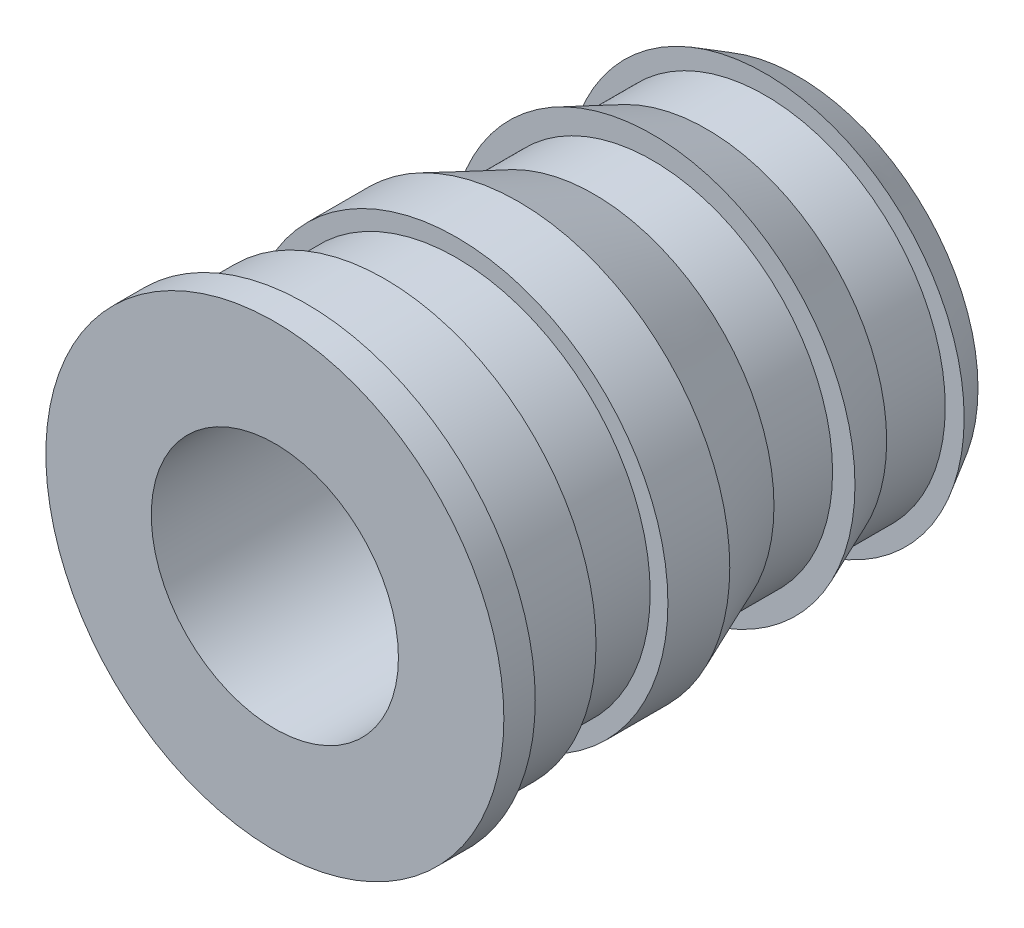
ISO-10303-21;
HEADER;
FILE_DESCRIPTION(('STEP AP214'),'2;1');
FILE_NAME('part.step','',(''),(''),'','','');
FILE_SCHEMA(('AUTOMOTIVE_DESIGN { 1 0 10303 214 1 1 1 1 }'));
ENDSEC;
DATA;
#1=APPLICATION_CONTEXT('core data for automotive mechanical design processes');
#2=APPLICATION_PROTOCOL_DEFINITION('international standard','automotive_design',2000,#1);
#3=PRODUCT_CONTEXT('',#1,'mechanical');
#4=PRODUCT('Part','Part','',(#3));
#5=PRODUCT_RELATED_PRODUCT_CATEGORY('part','',(#4));
#6=PRODUCT_DEFINITION_FORMATION('','',#4);
#7=PRODUCT_DEFINITION_CONTEXT('part definition',#1,'design');
#8=PRODUCT_DEFINITION('design','',#6,#7);
#9=PRODUCT_DEFINITION_SHAPE('','',#8);
#10=(LENGTH_UNIT() NAMED_UNIT(*) SI_UNIT(.MILLI.,.METRE.));
#11=(NAMED_UNIT(*) PLANE_ANGLE_UNIT() SI_UNIT($,.RADIAN.));
#12=(NAMED_UNIT(*) SI_UNIT($,.STERADIAN.) SOLID_ANGLE_UNIT());
#13=UNCERTAINTY_MEASURE_WITH_UNIT(LENGTH_MEASURE(1.E-05),#10,'distance_accuracy_value','');
#14=(GEOMETRIC_REPRESENTATION_CONTEXT(3) GLOBAL_UNCERTAINTY_ASSIGNED_CONTEXT((#13)) GLOBAL_UNIT_ASSIGNED_CONTEXT((#10,
#11,#12)) REPRESENTATION_CONTEXT('',''));
#15=CARTESIAN_POINT('',(0.,0.,0.));
#16=DIRECTION('',(0.,0.,1.));
#17=DIRECTION('',(1.,0.,0.));
#18=AXIS2_PLACEMENT_3D('',#15,#16,#17);
#19=CARTESIAN_POINT('',(0.,0.,3.175));
#20=DIRECTION('',(0.,0.,1.));
#21=DIRECTION('',(1.,0.,0.));
#22=AXIS2_PLACEMENT_3D('',#19,#20,#21);
#23=CYLINDRICAL_SURFACE('',#22,1.5);
#24=CARTESIAN_POINT('',(0.,0.,-3.175));
#25=DIRECTION('',(0.,0.,1.));
#26=DIRECTION('',(1.,0.,0.));
#27=AXIS2_PLACEMENT_3D('',#24,#25,#26);
#28=CIRCLE('',#27,1.5);
#29=CARTESIAN_POINT('',(1.5,0.,-3.175));
#30=VERTEX_POINT('',#29);
#31=EDGE_CURVE('E110',#30,#30,#28,.T.);
#32=ORIENTED_EDGE('',*,*,#31,.F.);
#33=EDGE_LOOP('',(#32));
#34=FACE_BOUND('',#33,.T.);
#35=CARTESIAN_POINT('',(0.,0.,3.175));
#36=DIRECTION('',(0.,0.,1.));
#37=DIRECTION('',(1.,0.,0.));
#38=AXIS2_PLACEMENT_3D('',#35,#36,#37);
#39=CIRCLE('',#38,1.5);
#40=CARTESIAN_POINT('',(1.5,0.,3.175));
#41=VERTEX_POINT('',#40);
#42=EDGE_CURVE('E10',#41,#41,#39,.T.);
#43=ORIENTED_EDGE('',*,*,#42,.T.);
#44=EDGE_LOOP('',(#43));
#45=FACE_BOUND('',#44,.T.);
#46=ADVANCED_FACE('F39',(#34,#45),#23,.F.);
#47=CARTESIAN_POINT('',(0.,1.5,3.175));
#48=DIRECTION('',(0.,0.,-1.));
#49=DIRECTION('',(-1.,0.,0.));
#50=AXIS2_PLACEMENT_3D('',#47,#48,#49);
#51=PLANE('',#50);
#52=ORIENTED_EDGE('',*,*,#42,.F.);
#53=EDGE_LOOP('',(#52));
#54=FACE_BOUND('',#53,.T.);
#55=CARTESIAN_POINT('',(0.,0.,3.175));
#56=DIRECTION('',(0.,0.,1.));
#57=DIRECTION('',(1.,0.,0.));
#58=AXIS2_PLACEMENT_3D('',#55,#56,#57);
#59=CIRCLE('',#58,2.78);
#60=CARTESIAN_POINT('',(2.78,0.,3.175));
#61=VERTEX_POINT('',#60);
#62=EDGE_CURVE('E46',#61,#61,#59,.T.);
#63=ORIENTED_EDGE('',*,*,#62,.T.);
#64=EDGE_LOOP('',(#63));
#65=FACE_BOUND('',#64,.T.);
#66=ADVANCED_FACE('F118',(#54,#65),#51,.F.);
#67=CARTESIAN_POINT('',(0.,0.,3.175));
#68=DIRECTION('',(0.,0.,1.));
#69=DIRECTION('',(1.,0.,0.));
#70=AXIS2_PLACEMENT_3D('',#67,#68,#69);
#71=CYLINDRICAL_SURFACE('',#70,2.78);
#72=ORIENTED_EDGE('',*,*,#62,.F.);
#73=EDGE_LOOP('',(#72));
#74=FACE_BOUND('',#73,.T.);
#75=CARTESIAN_POINT('',(0.,0.,2.794));
#76=DIRECTION('',(0.,0.,1.));
#77=DIRECTION('',(1.,0.,0.));
#78=AXIS2_PLACEMENT_3D('',#75,#76,#77);
#79=CIRCLE('',#78,2.78);
#80=CARTESIAN_POINT('',(2.78,0.,2.794));
#81=VERTEX_POINT('',#80);
#82=EDGE_CURVE('E51',#81,#81,#79,.T.);
#83=ORIENTED_EDGE('',*,*,#82,.T.);
#84=EDGE_LOOP('',(#83));
#85=FACE_BOUND('',#84,.T.);
#86=ADVANCED_FACE('F122',(#74,#85),#71,.T.);
#87=CARTESIAN_POINT('',(0.,2.78,2.794));
#88=DIRECTION('',(0.,0.,1.));
#89=DIRECTION('',(1.,0.,0.));
#90=AXIS2_PLACEMENT_3D('',#87,#88,#89);
#91=PLANE('',#90);
#92=ORIENTED_EDGE('',*,*,#82,.F.);
#93=EDGE_LOOP('',(#92));
#94=FACE_BOUND('',#93,.T.);
#95=CARTESIAN_POINT('',(0.,0.,2.794));
#96=DIRECTION('',(0.,0.,1.));
#97=DIRECTION('',(1.,0.,0.));
#98=AXIS2_PLACEMENT_3D('',#95,#96,#97);
#99=CIRCLE('',#98,2.565);
#100=CARTESIAN_POINT('',(2.565,0.,2.794));
#101=VERTEX_POINT('',#100);
#102=EDGE_CURVE('E56',#101,#101,#99,.T.);
#103=ORIENTED_EDGE('',*,*,#102,.T.);
#104=EDGE_LOOP('',(#103));
#105=FACE_BOUND('',#104,.T.);
#106=ADVANCED_FACE('F127',(#94,#105),#91,.F.);
#107=CARTESIAN_POINT('',(0.,0.,3.175));
#108=DIRECTION('',(0.,0.,1.));
#109=DIRECTION('',(1.,0.,0.));
#110=AXIS2_PLACEMENT_3D('',#107,#108,#109);
#111=CYLINDRICAL_SURFACE('',#110,2.565);
#112=ORIENTED_EDGE('',*,*,#102,.F.);
#113=EDGE_LOOP('',(#112));
#114=FACE_BOUND('',#113,.T.);
#115=CARTESIAN_POINT('',(0.,0.,1.8415));
#116=DIRECTION('',(0.,0.,1.));
#117=DIRECTION('',(1.,0.,0.));
#118=AXIS2_PLACEMENT_3D('',#115,#116,#117);
#119=CIRCLE('',#118,2.565);
#120=CARTESIAN_POINT('',(2.565,0.,1.8415));
#121=VERTEX_POINT('',#120);
#122=EDGE_CURVE('E62',#121,#121,#119,.T.);
#123=ORIENTED_EDGE('',*,*,#122,.T.);
#124=EDGE_LOOP('',(#123));
#125=FACE_BOUND('',#124,.T.);
#126=ADVANCED_FACE('F133',(#114,#125),#111,.T.);
#127=CARTESIAN_POINT('',(0.,2.565,1.8415));
#128=DIRECTION('',(0.,0.,1.));
#129=DIRECTION('',(1.,0.,0.));
#130=AXIS2_PLACEMENT_3D('',#127,#128,#129);
#131=PLANE('',#130);
#132=ORIENTED_EDGE('',*,*,#122,.F.);
#133=EDGE_LOOP('',(#132));
#134=FACE_BOUND('',#133,.T.);
#135=CARTESIAN_POINT('',(0.,0.,1.8415));
#136=DIRECTION('',(0.,0.,1.));
#137=DIRECTION('',(1.,0.,0.));
#138=AXIS2_PLACEMENT_3D('',#135,#136,#137);
#139=CIRCLE('',#138,2.35);
#140=CARTESIAN_POINT('',(2.35,0.,1.8415));
#141=VERTEX_POINT('',#140);
#142=EDGE_CURVE('E66',#141,#141,#139,.T.);
#143=ORIENTED_EDGE('',*,*,#142,.T.);
#144=EDGE_LOOP('',(#143));
#145=FACE_BOUND('',#144,.T.);
#146=ADVANCED_FACE('F137',(#134,#145),#131,.F.);
#147=CARTESIAN_POINT('',(0.,0.,3.175));
#148=DIRECTION('',(0.,0.,1.));
#149=DIRECTION('',(1.,0.,0.));
#150=AXIS2_PLACEMENT_3D('',#147,#148,#149);
#151=CYLINDRICAL_SURFACE('',#150,2.35);
#152=ORIENTED_EDGE('',*,*,#142,.F.);
#153=EDGE_LOOP('',(#152));
#154=FACE_BOUND('',#153,.T.);
#155=CARTESIAN_POINT('',(0.,0.,0.968638131010374));
#156=DIRECTION('',(0.,0.,1.));
#157=DIRECTION('',(1.,0.,0.));
#158=AXIS2_PLACEMENT_3D('',#155,#156,#157);
#159=CIRCLE('',#158,2.35);
#160=CARTESIAN_POINT('',(2.35,0.,0.968638131010374));
#161=VERTEX_POINT('',#160);
#162=EDGE_CURVE('E70',#161,#161,#159,.T.);
#163=ORIENTED_EDGE('',*,*,#162,.T.);
#164=EDGE_LOOP('',(#163));
#165=FACE_BOUND('',#164,.T.);
#166=ADVANCED_FACE('F141',(#154,#165),#151,.T.);
#167=CARTESIAN_POINT('',(0.,2.35,0.968638131010374));
#168=DIRECTION('',(0.,0.,-1.));
#169=DIRECTION('',(-1.,0.,0.));
#170=AXIS2_PLACEMENT_3D('',#167,#168,#169);
#171=PLANE('',#170);
#172=ORIENTED_EDGE('',*,*,#162,.F.);
#173=EDGE_LOOP('',(#172));
#174=FACE_BOUND('',#173,.T.);
#175=CARTESIAN_POINT('',(0.,0.,0.968638131010374));
#176=DIRECTION('',(0.,0.,1.));
#177=DIRECTION('',(1.,0.,0.));
#178=AXIS2_PLACEMENT_3D('',#175,#176,#177);
#179=CIRCLE('',#178,2.565);
#180=CARTESIAN_POINT('',(2.565,0.,0.968638131010374));
#181=VERTEX_POINT('',#180);
#182=EDGE_CURVE('E74',#181,#181,#179,.T.);
#183=ORIENTED_EDGE('',*,*,#182,.T.);
#184=EDGE_LOOP('',(#183));
#185=FACE_BOUND('',#184,.T.);
#186=ADVANCED_FACE('F145',(#174,#185),#171,.F.);
#187=CARTESIAN_POINT('',(0.,0.,3.175));
#188=DIRECTION('',(0.,0.,1.));
#189=DIRECTION('',(1.,0.,0.));
#190=AXIS2_PLACEMENT_3D('',#187,#188,#189);
#191=CYLINDRICAL_SURFACE('',#190,2.565);
#192=ORIENTED_EDGE('',*,*,#182,.F.);
#193=EDGE_LOOP('',(#192));
#194=FACE_BOUND('',#193,.T.);
#195=CARTESIAN_POINT('',(0.,0.,0.217694046920587));
#196=DIRECTION('',(0.,0.,1.));
#197=DIRECTION('',(1.,0.,0.));
#198=AXIS2_PLACEMENT_3D('',#195,#196,#197);
#199=CIRCLE('',#198,2.565);
#200=CARTESIAN_POINT('',(2.565,0.,0.217694046920587));
#201=VERTEX_POINT('',#200);
#202=EDGE_CURVE('E78',#201,#201,#199,.T.);
#203=ORIENTED_EDGE('',*,*,#202,.T.);
#204=EDGE_LOOP('',(#203));
#205=FACE_BOUND('',#204,.T.);
#206=ADVANCED_FACE('F149',(#194,#205),#191,.T.);
#207=CARTESIAN_POINT('',(0.,0.,-0.698499999999999));
#208=DIRECTION('',(0.,0.,1.));
#209=DIRECTION('',(1.,0.,0.));
#210=AXIS2_PLACEMENT_3D('',#207,#208,#209);
#211=CONICAL_SURFACE('',#210,2.1855,0.392699081698725);
#212=ORIENTED_EDGE('',*,*,#202,.F.);
#213=EDGE_LOOP('',(#212));
#214=FACE_BOUND('',#213,.T.);
#215=CARTESIAN_POINT('',(0.,0.,-0.698499999999999));
#216=DIRECTION('',(0.,0.,1.));
#217=DIRECTION('',(1.,0.,0.));
#218=AXIS2_PLACEMENT_3D('',#215,#216,#217);
#219=CIRCLE('',#218,2.1855);
#220=CARTESIAN_POINT('',(2.1855,0.,-0.698499999999999));
#221=VERTEX_POINT('',#220);
#222=EDGE_CURVE('E82',#221,#221,#219,.T.);
#223=ORIENTED_EDGE('',*,*,#222,.T.);
#224=EDGE_LOOP('',(#223));
#225=FACE_BOUND('',#224,.T.);
#226=ADVANCED_FACE('F153',(#214,#225),#211,.T.);
#227=CARTESIAN_POINT('',(0.,0.,3.175));
#228=DIRECTION('',(0.,0.,1.));
#229=DIRECTION('',(1.,0.,0.));
#230=AXIS2_PLACEMENT_3D('',#227,#228,#229);
#231=CYLINDRICAL_SURFACE('',#230,2.1855);
#232=ORIENTED_EDGE('',*,*,#222,.F.);
#233=EDGE_LOOP('',(#232));
#234=FACE_BOUND('',#233,.T.);
#235=CARTESIAN_POINT('',(0.,0.,-1.40966412534873));
#236=DIRECTION('',(0.,0.,1.));
#237=DIRECTION('',(1.,0.,0.));
#238=AXIS2_PLACEMENT_3D('',#235,#236,#237);
#239=CIRCLE('',#238,2.1855);
#240=CARTESIAN_POINT('',(2.1855,0.,-1.40966412534873));
#241=VERTEX_POINT('',#240);
#242=EDGE_CURVE('E86',#241,#241,#239,.T.);
#243=ORIENTED_EDGE('',*,*,#242,.T.);
#244=EDGE_LOOP('',(#243));
#245=FACE_BOUND('',#244,.T.);
#246=ADVANCED_FACE('F157',(#234,#245),#231,.T.);
#247=CARTESIAN_POINT('',(0.,2.4575,-1.40966412534873));
#248=DIRECTION('',(0.,0.,-1.));
#249=DIRECTION('',(-1.,0.,0.));
#250=AXIS2_PLACEMENT_3D('',#247,#248,#249);
#251=PLANE('',#250);
#252=ORIENTED_EDGE('',*,*,#242,.F.);
#253=EDGE_LOOP('',(#252));
#254=FACE_BOUND('',#253,.T.);
#255=CARTESIAN_POINT('',(0.,0.,-1.40966412534873));
#256=DIRECTION('',(0.,0.,1.));
#257=DIRECTION('',(1.,0.,0.));
#258=AXIS2_PLACEMENT_3D('',#255,#256,#257);
#259=CIRCLE('',#258,2.4575);
#260=CARTESIAN_POINT('',(2.4575,0.,-1.40966412534873));
#261=VERTEX_POINT('',#260);
#262=EDGE_CURVE('E90',#261,#261,#259,.T.);
#263=ORIENTED_EDGE('',*,*,#262,.T.);
#264=EDGE_LOOP('',(#263));
#265=FACE_BOUND('',#264,.T.);
#266=ADVANCED_FACE('F161',(#254,#265),#251,.F.);
#267=CARTESIAN_POINT('',(0.,0.,-2.06633021431421));
#268=DIRECTION('',(0.,0.,1.));
#269=DIRECTION('',(1.,0.,0.));
#270=AXIS2_PLACEMENT_3D('',#267,#268,#269);
#271=CONICAL_SURFACE('',#270,2.1855,0.392699081698724);
#272=ORIENTED_EDGE('',*,*,#262,.F.);
#273=EDGE_LOOP('',(#272));
#274=FACE_BOUND('',#273,.T.);
#275=CARTESIAN_POINT('',(0.,0.,-2.06633021431421));
#276=DIRECTION('',(0.,0.,1.));
#277=DIRECTION('',(1.,0.,0.));
#278=AXIS2_PLACEMENT_3D('',#275,#276,#277);
#279=CIRCLE('',#278,2.1855);
#280=CARTESIAN_POINT('',(2.1855,0.,-2.06633021431421));
#281=VERTEX_POINT('',#280);
#282=EDGE_CURVE('E94',#281,#281,#279,.T.);
#283=ORIENTED_EDGE('',*,*,#282,.T.);
#284=EDGE_LOOP('',(#283));
#285=FACE_BOUND('',#284,.T.);
#286=ADVANCED_FACE('F165',(#274,#285),#271,.T.);
#287=CARTESIAN_POINT('',(0.,0.,3.175));
#288=DIRECTION('',(0.,0.,1.));
#289=DIRECTION('',(1.,0.,0.));
#290=AXIS2_PLACEMENT_3D('',#287,#288,#289);
#291=CYLINDRICAL_SURFACE('',#290,2.1855);
#292=ORIENTED_EDGE('',*,*,#282,.F.);
#293=EDGE_LOOP('',(#292));
#294=FACE_BOUND('',#293,.T.);
#295=CARTESIAN_POINT('',(0.,0.,-2.77749433966294));
#296=DIRECTION('',(0.,0.,1.));
#297=DIRECTION('',(1.,0.,0.));
#298=AXIS2_PLACEMENT_3D('',#295,#296,#297);
#299=CIRCLE('',#298,2.1855);
#300=CARTESIAN_POINT('',(2.1855,0.,-2.77749433966294));
#301=VERTEX_POINT('',#300);
#302=EDGE_CURVE('E98',#301,#301,#299,.T.);
#303=ORIENTED_EDGE('',*,*,#302,.T.);
#304=EDGE_LOOP('',(#303));
#305=FACE_BOUND('',#304,.T.);
#306=ADVANCED_FACE('F169',(#294,#305),#291,.T.);
#307=CARTESIAN_POINT('',(0.,2.1855,-2.77749433966294));
#308=DIRECTION('',(0.,0.,-1.));
#309=DIRECTION('',(-1.,0.,0.));
#310=AXIS2_PLACEMENT_3D('',#307,#308,#309);
#311=PLANE('',#310);
#312=ORIENTED_EDGE('',*,*,#302,.F.);
#313=EDGE_LOOP('',(#312));
#314=FACE_BOUND('',#313,.T.);
#315=CARTESIAN_POINT('',(0.,0.,-2.77749433966294));
#316=DIRECTION('',(0.,0.,1.));
#317=DIRECTION('',(1.,0.,0.));
#318=AXIS2_PLACEMENT_3D('',#315,#316,#317);
#319=CIRCLE('',#318,2.415);
#320=CARTESIAN_POINT('',(2.415,0.,-2.77749433966294));
#321=VERTEX_POINT('',#320);
#322=EDGE_CURVE('E102',#321,#321,#319,.T.);
#323=ORIENTED_EDGE('',*,*,#322,.T.);
#324=EDGE_LOOP('',(#323));
#325=FACE_BOUND('',#324,.T.);
#326=ADVANCED_FACE('F173',(#314,#325),#311,.F.);
#327=CARTESIAN_POINT('',(0.,0.,-3.175));
#328=DIRECTION('',(0.,0.,1.));
#329=DIRECTION('',(1.,0.,0.));
#330=AXIS2_PLACEMENT_3D('',#327,#328,#329);
#331=CONICAL_SURFACE('',#330,2.1855,0.523598775598298);
#332=ORIENTED_EDGE('',*,*,#322,.F.);
#333=EDGE_LOOP('',(#332));
#334=FACE_BOUND('',#333,.T.);
#335=CARTESIAN_POINT('',(0.,0.,-3.175));
#336=DIRECTION('',(0.,0.,1.));
#337=DIRECTION('',(1.,0.,0.));
#338=AXIS2_PLACEMENT_3D('',#335,#336,#337);
#339=CIRCLE('',#338,2.1855);
#340=CARTESIAN_POINT('',(2.1855,0.,-3.175));
#341=VERTEX_POINT('',#340);
#342=EDGE_CURVE('E106',#341,#341,#339,.T.);
#343=ORIENTED_EDGE('',*,*,#342,.T.);
#344=EDGE_LOOP('',(#343));
#345=FACE_BOUND('',#344,.T.);
#346=ADVANCED_FACE('F177',(#334,#345),#331,.T.);
#347=CARTESIAN_POINT('',(0.,2.1855,-3.175));
#348=DIRECTION('',(0.,0.,1.));
#349=DIRECTION('',(1.,0.,0.));
#350=AXIS2_PLACEMENT_3D('',#347,#348,#349);
#351=PLANE('',#350);
#352=ORIENTED_EDGE('',*,*,#342,.F.);
#353=EDGE_LOOP('',(#352));
#354=FACE_BOUND('',#353,.T.);
#355=ORIENTED_EDGE('',*,*,#31,.T.);
#356=EDGE_LOOP('',(#355));
#357=FACE_BOUND('',#356,.T.);
#358=ADVANCED_FACE('F115',(#354,#357),#351,.F.);
#359=CLOSED_SHELL('',(#46,#66,#86,#106,#126,#146,#166,#186,#206,#226,#246,#266,#286,#306,#326,
#346,#358));
#360=MANIFOLD_SOLID_BREP('B2',#359);
#361=ADVANCED_BREP_SHAPE_REPRESENTATION('',(#18,#360),#14);
#362=SHAPE_DEFINITION_REPRESENTATION(#9,#361);
ENDSEC;
END-ISO-10303-21;
